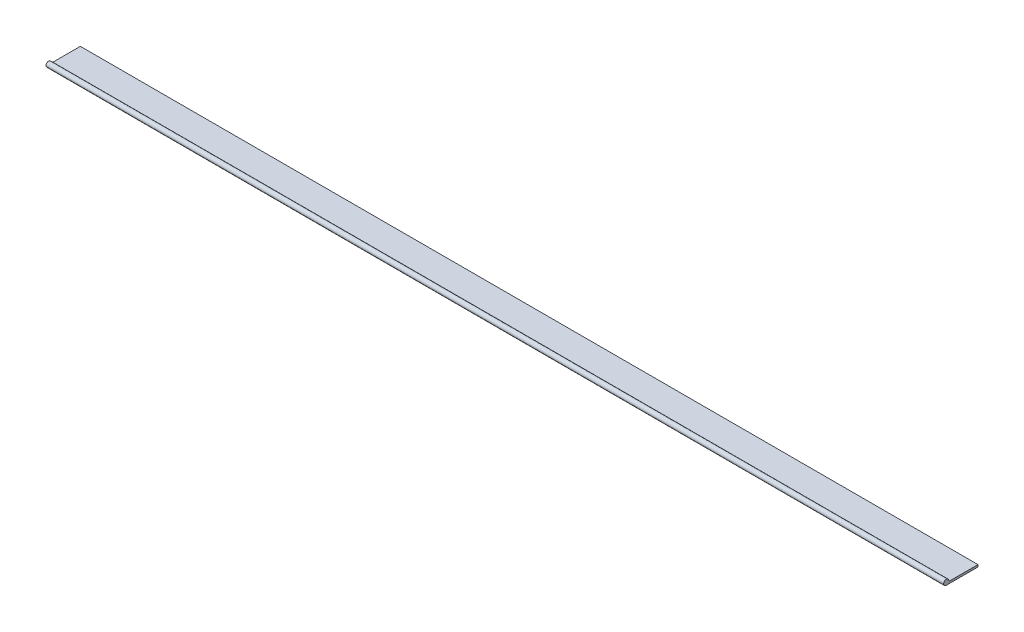
ISO-10303-21;
HEADER;
FILE_DESCRIPTION(('STEP AP214'),'2;1');
FILE_NAME('part.step','',(''),(''),'','','');
FILE_SCHEMA(('AUTOMOTIVE_DESIGN { 1 0 10303 214 1 1 1 1 }'));
ENDSEC;
DATA;
#1=APPLICATION_CONTEXT('core data for automotive mechanical design processes');
#2=APPLICATION_PROTOCOL_DEFINITION('international standard','automotive_design',2000,#1);
#3=PRODUCT_CONTEXT('',#1,'mechanical');
#4=PRODUCT('Part','Part','',(#3));
#5=PRODUCT_RELATED_PRODUCT_CATEGORY('part','',(#4));
#6=PRODUCT_DEFINITION_FORMATION('','',#4);
#7=PRODUCT_DEFINITION_CONTEXT('part definition',#1,'design');
#8=PRODUCT_DEFINITION('design','',#6,#7);
#9=PRODUCT_DEFINITION_SHAPE('','',#8);
#10=(LENGTH_UNIT() NAMED_UNIT(*) SI_UNIT(.MILLI.,.METRE.));
#11=(NAMED_UNIT(*) PLANE_ANGLE_UNIT() SI_UNIT($,.RADIAN.));
#12=(NAMED_UNIT(*) SI_UNIT($,.STERADIAN.) SOLID_ANGLE_UNIT());
#13=UNCERTAINTY_MEASURE_WITH_UNIT(LENGTH_MEASURE(1.E-05),#10,'distance_accuracy_value','');
#14=(GEOMETRIC_REPRESENTATION_CONTEXT(3) GLOBAL_UNCERTAINTY_ASSIGNED_CONTEXT((#13)) GLOBAL_UNIT_ASSIGNED_CONTEXT((#10,
#11,#12)) REPRESENTATION_CONTEXT('',''));
#15=CARTESIAN_POINT('',(0.,0.,0.));
#16=DIRECTION('',(0.,0.,1.));
#17=DIRECTION('',(1.,0.,0.));
#18=AXIS2_PLACEMENT_3D('',#15,#16,#17);
#19=CARTESIAN_POINT('',(273.05,0.79375,0.));
#20=DIRECTION('',(-1.,0.,0.));
#21=DIRECTION('',(0.,0.,1.));
#22=AXIS2_PLACEMENT_3D('',#19,#20,#21);
#23=CYLINDRICAL_SURFACE('',#22,0.79375);
#24=CARTESIAN_POINT('',(0.,0.79375,0.));
#25=DIRECTION('',(1.,0.,0.));
#26=DIRECTION('',(0.,0.,-1.));
#27=AXIS2_PLACEMENT_3D('',#24,#25,#26);
#28=CIRCLE('',#27,0.79375);
#29=CARTESIAN_POINT('',(0.,0.635,-0.777712993333659));
#30=VERTEX_POINT('',#29);
#31=CARTESIAN_POINT('',(0.,0.,0.));
#32=VERTEX_POINT('',#31);
#33=EDGE_CURVE('E98',#30,#32,#28,.T.);
#34=ORIENTED_EDGE('',*,*,#33,.T.);
#35=DIRECTION('',(-1.,0.,0.));
#36=VECTOR('',#35,1.);
#37=CARTESIAN_POINT('',(273.05,0.,0.));
#38=LINE('',#37,#36);
#39=CARTESIAN_POINT('',(273.05,0.,0.));
#40=VERTEX_POINT('',#39);
#41=EDGE_CURVE('E11',#40,#32,#38,.T.);
#42=ORIENTED_EDGE('',*,*,#41,.F.);
#43=CARTESIAN_POINT('',(273.05,0.79375,0.));
#44=DIRECTION('',(1.,0.,0.));
#45=DIRECTION('',(0.,0.,-1.));
#46=AXIS2_PLACEMENT_3D('',#43,#44,#45);
#47=CIRCLE('',#46,0.79375);
#48=CARTESIAN_POINT('',(273.05,0.635,-0.777712993333659));
#49=VERTEX_POINT('',#48);
#50=EDGE_CURVE('E86',#49,#40,#47,.T.);
#51=ORIENTED_EDGE('',*,*,#50,.F.);
#52=DIRECTION('',(-1.,0.,0.));
#53=VECTOR('',#52,1.);
#54=CARTESIAN_POINT('',(273.05,0.635,-0.777712993333659));
#55=LINE('',#54,#53);
#56=EDGE_CURVE('E94',#49,#30,#55,.T.);
#57=ORIENTED_EDGE('',*,*,#56,.T.);
#58=EDGE_LOOP('',(#34,#42,#51,#57));
#59=FACE_BOUND('',#58,.T.);
#60=ADVANCED_FACE('F35',(#59),#23,.T.);
#61=CARTESIAN_POINT('',(273.05,0.,0.));
#62=DIRECTION('',(0.,1.,0.));
#63=DIRECTION('',(0.,0.,1.));
#64=AXIS2_PLACEMENT_3D('',#61,#62,#63);
#65=PLANE('',#64);
#66=DIRECTION('',(0.,0.,-1.));
#67=VECTOR('',#66,1.);
#68=CARTESIAN_POINT('',(0.,0.,0.));
#69=LINE('',#68,#67);
#70=CARTESIAN_POINT('',(0.,0.,-9.652));
#71=VERTEX_POINT('',#70);
#72=EDGE_CURVE('E90',#32,#71,#69,.T.);
#73=ORIENTED_EDGE('',*,*,#72,.T.);
#74=DIRECTION('',(-1.,0.,0.));
#75=VECTOR('',#74,1.);
#76=CARTESIAN_POINT('',(273.05,0.,-9.652));
#77=LINE('',#76,#75);
#78=CARTESIAN_POINT('',(273.05,0.,-9.652));
#79=VERTEX_POINT('',#78);
#80=EDGE_CURVE('E43',#79,#71,#77,.T.);
#81=ORIENTED_EDGE('',*,*,#80,.F.);
#82=DIRECTION('',(0.,0.,-1.));
#83=VECTOR('',#82,1.);
#84=CARTESIAN_POINT('',(273.05,0.,0.));
#85=LINE('',#84,#83);
#86=EDGE_CURVE('E81',#40,#79,#85,.T.);
#87=ORIENTED_EDGE('',*,*,#86,.F.);
#88=ORIENTED_EDGE('',*,*,#41,.T.);
#89=EDGE_LOOP('',(#73,#81,#87,#88));
#90=FACE_BOUND('',#89,.T.);
#91=ADVANCED_FACE('F89',(#90),#65,.F.);
#92=CARTESIAN_POINT('',(273.05,0.,-9.652));
#93=DIRECTION('',(0.,0.,1.));
#94=DIRECTION('',(1.,0.,0.));
#95=AXIS2_PLACEMENT_3D('',#92,#93,#94);
#96=PLANE('',#95);
#97=DIRECTION('',(0.,1.,0.));
#98=VECTOR('',#97,1.);
#99=CARTESIAN_POINT('',(0.,0.,-9.652));
#100=LINE('',#99,#98);
#101=CARTESIAN_POINT('',(0.,0.635,-9.652));
#102=VERTEX_POINT('',#101);
#103=EDGE_CURVE('E68',#71,#102,#100,.T.);
#104=ORIENTED_EDGE('',*,*,#103,.T.);
#105=DIRECTION('',(-1.,0.,0.));
#106=VECTOR('',#105,1.);
#107=CARTESIAN_POINT('',(273.05,0.635,-9.652));
#108=LINE('',#107,#106);
#109=CARTESIAN_POINT('',(273.05,0.635,-9.652));
#110=VERTEX_POINT('',#109);
#111=EDGE_CURVE('E91',#110,#102,#108,.T.);
#112=ORIENTED_EDGE('',*,*,#111,.F.);
#113=DIRECTION('',(0.,1.,0.));
#114=VECTOR('',#113,1.);
#115=CARTESIAN_POINT('',(273.05,0.,-9.652));
#116=LINE('',#115,#114);
#117=EDGE_CURVE('E84',#79,#110,#116,.T.);
#118=ORIENTED_EDGE('',*,*,#117,.F.);
#119=ORIENTED_EDGE('',*,*,#80,.T.);
#120=EDGE_LOOP('',(#104,#112,#118,#119));
#121=FACE_BOUND('',#120,.T.);
#122=ADVANCED_FACE('F92',(#121),#96,.F.);
#123=CARTESIAN_POINT('',(273.05,0.635,-9.652));
#124=DIRECTION('',(0.,-1.,0.));
#125=DIRECTION('',(0.,0.,-1.));
#126=AXIS2_PLACEMENT_3D('',#123,#124,#125);
#127=PLANE('',#126);
#128=DIRECTION('',(0.,0.,1.));
#129=VECTOR('',#128,1.);
#130=CARTESIAN_POINT('',(0.,0.635,-9.652));
#131=LINE('',#130,#129);
#132=EDGE_CURVE('E74',#102,#30,#131,.T.);
#133=ORIENTED_EDGE('',*,*,#132,.T.);
#134=ORIENTED_EDGE('',*,*,#56,.F.);
#135=DIRECTION('',(0.,0.,1.));
#136=VECTOR('',#135,1.);
#137=CARTESIAN_POINT('',(273.05,0.635,-9.652));
#138=LINE('',#137,#136);
#139=EDGE_CURVE('E51',#110,#49,#138,.T.);
#140=ORIENTED_EDGE('',*,*,#139,.F.);
#141=ORIENTED_EDGE('',*,*,#111,.T.);
#142=EDGE_LOOP('',(#133,#134,#140,#141));
#143=FACE_BOUND('',#142,.T.);
#144=ADVANCED_FACE('F105',(#143),#127,.F.);
#145=CARTESIAN_POINT('',(273.05,0.79375,0.));
#146=DIRECTION('',(1.,0.,0.));
#147=DIRECTION('',(0.,0.,-1.));
#148=AXIS2_PLACEMENT_3D('',#145,#146,#147);
#149=PLANE('',#148);
#150=ORIENTED_EDGE('',*,*,#50,.T.);
#151=ORIENTED_EDGE('',*,*,#86,.T.);
#152=ORIENTED_EDGE('',*,*,#117,.T.);
#153=ORIENTED_EDGE('',*,*,#139,.T.);
#154=EDGE_LOOP('',(#150,#151,#152,#153));
#155=FACE_BOUND('',#154,.T.);
#156=ADVANCED_FACE('F82',(#155),#149,.T.);
#157=CARTESIAN_POINT('',(0.,0.79375,0.));
#158=DIRECTION('',(1.,0.,0.));
#159=DIRECTION('',(0.,0.,-1.));
#160=AXIS2_PLACEMENT_3D('',#157,#158,#159);
#161=PLANE('',#160);
#162=ORIENTED_EDGE('',*,*,#33,.F.);
#163=ORIENTED_EDGE('',*,*,#132,.F.);
#164=ORIENTED_EDGE('',*,*,#103,.F.);
#165=ORIENTED_EDGE('',*,*,#72,.F.);
#166=EDGE_LOOP('',(#162,#163,#164,#165));
#167=FACE_BOUND('',#166,.T.);
#168=ADVANCED_FACE('F108',(#167),#161,.F.);
#169=CLOSED_SHELL('',(#60,#91,#122,#144,#156,#168));
#170=MANIFOLD_SOLID_BREP('B2',#169);
#171=ADVANCED_BREP_SHAPE_REPRESENTATION('',(#18,#170),#14);
#172=SHAPE_DEFINITION_REPRESENTATION(#9,#171);
ENDSEC;
END-ISO-10303-21;
